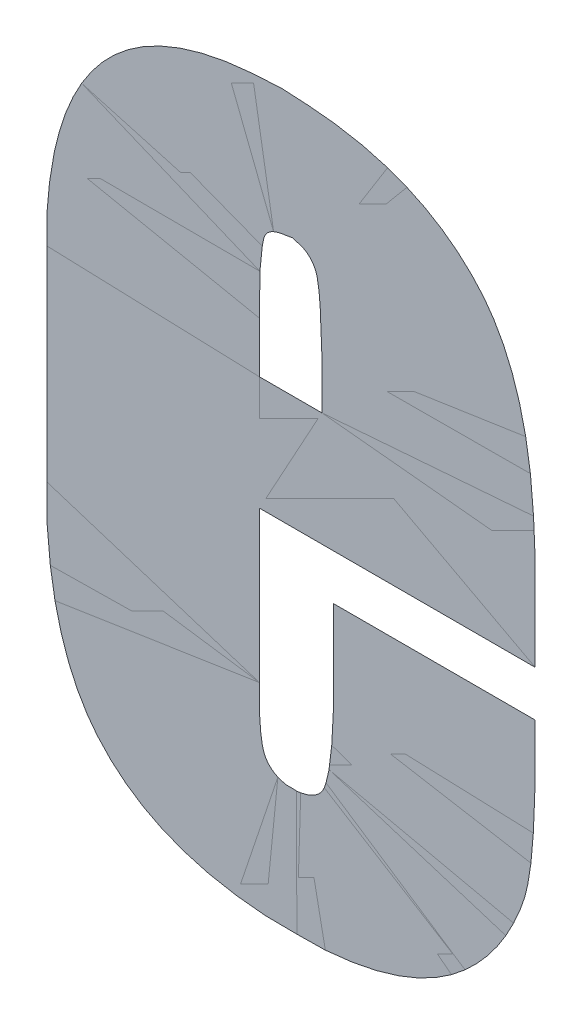
ISO-10303-21;
HEADER;
FILE_DESCRIPTION(('STEP AP214'),'2;1');
FILE_NAME('part.step','',(''),(''),'','','');
FILE_SCHEMA(('AUTOMOTIVE_DESIGN { 1 0 10303 214 1 1 1 1 }'));
ENDSEC;
DATA;
#1=APPLICATION_CONTEXT('core data for automotive mechanical design processes');
#2=APPLICATION_PROTOCOL_DEFINITION('international standard','automotive_design',2000,#1);
#3=PRODUCT_CONTEXT('',#1,'mechanical');
#4=PRODUCT('Part','Part','',(#3));
#5=PRODUCT_RELATED_PRODUCT_CATEGORY('part','',(#4));
#6=PRODUCT_DEFINITION_FORMATION('','',#4);
#7=PRODUCT_DEFINITION_CONTEXT('part definition',#1,'design');
#8=PRODUCT_DEFINITION('design','',#6,#7);
#9=PRODUCT_DEFINITION_SHAPE('','',#8);
#10=(LENGTH_UNIT() NAMED_UNIT(*) SI_UNIT(.MILLI.,.METRE.));
#11=(NAMED_UNIT(*) PLANE_ANGLE_UNIT() SI_UNIT($,.RADIAN.));
#12=(NAMED_UNIT(*) SI_UNIT($,.STERADIAN.) SOLID_ANGLE_UNIT());
#13=UNCERTAINTY_MEASURE_WITH_UNIT(LENGTH_MEASURE(1.E-05),#10,'distance_accuracy_value','');
#14=(GEOMETRIC_REPRESENTATION_CONTEXT(3) GLOBAL_UNCERTAINTY_ASSIGNED_CONTEXT((#13)) GLOBAL_UNIT_ASSIGNED_CONTEXT((#10,
#11,#12)) REPRESENTATION_CONTEXT('',''));
#15=CARTESIAN_POINT('',(0.,0.,0.));
#16=DIRECTION('',(0.,0.,1.));
#17=DIRECTION('',(1.,0.,0.));
#18=AXIS2_PLACEMENT_3D('',#15,#16,#17);
#19=CARTESIAN_POINT('',(6.400952267029,0.774329220897,0.001668));
#20=DIRECTION('',(0.,0.,1.));
#21=DIRECTION('',(1.,0.,0.));
#22=AXIS2_PLACEMENT_3D('',#19,#20,#21);
#23=PLANE('',#22);
#24=CARTESIAN_POINT('',(6.396476040739,0.844309953316,0.001668));
#25=CARTESIAN_POINT('',(6.40095970380509,0.84399688503704,0.001668));
#26=CARTESIAN_POINT('',(6.40272170775,0.840174308944,0.001668));
#27=CARTESIAN_POINT('',(6.40424092405,0.836878448043519,0.001668));
#28=CARTESIAN_POINT('',(6.40424092405,0.821690510628,0.001668));
#29=B_SPLINE_CURVE_WITH_KNOTS('',2,(#24,#25,#26,#27,#28),.UNSPECIFIED.,.F.,.F.,(3,2,3),(0.,0.5,
1.),.UNSPECIFIED.);
#30=CARTESIAN_POINT('',(6.396476040739,0.844309953316,0.0015));
#31=VERTEX_POINT('',#30);
#32=CARTESIAN_POINT('',(6.40424092405,0.821690510628,0.0015));
#33=VERTEX_POINT('',#32);
#34=EDGE_CURVE('E303',#31,#33,#29,.T.);
#35=ORIENTED_EDGE('',*,*,#34,.T.);
#36=CARTESIAN_POINT('',(6.40424092405,0.821690510628,0.001668));
#37=DIRECTION('',(0.,-1.,0.));
#38=VECTOR('',#37,1.);
#39=LINE('',#36,#38);
#40=CARTESIAN_POINT('',(6.40424092405,0.80835516755,0.0015));
#41=VERTEX_POINT('',#40);
#42=EDGE_CURVE('E28',#33,#41,#39,.T.);
#43=ORIENTED_EDGE('',*,*,#42,.T.);
#44=CARTESIAN_POINT('',(6.40424092405,0.80835516755,0.001668));
#45=DIRECTION('',(-1.,0.,0.));
#46=VECTOR('',#45,1.);
#47=LINE('',#44,#46);
#48=CARTESIAN_POINT('',(6.387867148373,0.80835516755,0.0015));
#49=VERTEX_POINT('',#48);
#50=EDGE_CURVE('E11',#41,#49,#47,.T.);
#51=ORIENTED_EDGE('',*,*,#50,.T.);
#52=CARTESIAN_POINT('',(6.387867148373,0.80835516755,0.001668));
#53=DIRECTION('',(0.,1.,0.));
#54=VECTOR('',#53,1.);
#55=LINE('',#52,#54);
#56=CARTESIAN_POINT('',(6.387867148373,0.821690510628,0.0015));
#57=VERTEX_POINT('',#56);
#58=EDGE_CURVE('E101',#49,#57,#55,.T.);
#59=ORIENTED_EDGE('',*,*,#58,.T.);
#60=CARTESIAN_POINT('',(6.387867148373,0.821690510628,0.001668));
#61=CARTESIAN_POINT('',(6.387867148373,0.835948392219936,0.001668));
#62=CARTESIAN_POINT('',(6.3892175628615,0.840765115283,0.001668));
#63=CARTESIAN_POINT('',(6.39012550966034,0.844003623402732,0.001668));
#64=CARTESIAN_POINT('',(6.396476040739,0.844309953316,0.001668));
#65=B_SPLINE_CURVE_WITH_KNOTS('',2,(#60,#61,#62,#63,#64),.UNSPECIFIED.,.F.,.F.,(3,2,3),(0.,0.5,
1.),.UNSPECIFIED.);
#66=EDGE_CURVE('E293',#57,#31,#65,.T.);
#67=ORIENTED_EDGE('',*,*,#66,.T.);
#68=EDGE_LOOP('',(#35,#43,#51,#59,#67));
#69=FACE_BOUND('',#68,.T.);
#70=CARTESIAN_POINT('',(6.39664484255,0.719059009475,0.001668));
#71=CARTESIAN_POINT('',(6.39167394149655,0.719333742862682,0.001668));
#72=CARTESIAN_POINT('',(6.3896395673895,0.722688248414,0.001668));
#73=CARTESIAN_POINT('',(6.387867148373,0.72561081285753,0.001668));
#74=CARTESIAN_POINT('',(6.387867148373,0.738808821375,0.001668));
#75=B_SPLINE_CURVE_WITH_KNOTS('',2,(#70,#71,#72,#73,#74),.UNSPECIFIED.,.F.,.F.,(3,2,3),(0.,0.5,
1.),.UNSPECIFIED.);
#76=CARTESIAN_POINT('',(6.39664484255,0.719059009475,0.0015));
#77=VERTEX_POINT('',#76);
#78=CARTESIAN_POINT('',(6.387867148373,0.738808821375,0.0015));
#79=VERTEX_POINT('',#78);
#80=EDGE_CURVE('E279',#77,#79,#75,.T.);
#81=ORIENTED_EDGE('',*,*,#80,.T.);
#82=CARTESIAN_POINT('',(6.387867148373,0.738808821375,0.001668));
#83=DIRECTION('',(0.,1.,0.));
#84=VECTOR('',#83,1.);
#85=LINE('',#82,#84);
#86=CARTESIAN_POINT('',(6.387867148373,0.778477246985,0.0015));
#87=VERTEX_POINT('',#86);
#88=EDGE_CURVE('E99',#79,#87,#85,.T.);
#89=ORIENTED_EDGE('',*,*,#88,.T.);
#90=CARTESIAN_POINT('',(6.387867148373,0.778477246985,0.001668));
#91=DIRECTION('',(1.,0.,0.));
#92=VECTOR('',#91,1.);
#93=LINE('',#90,#92);
#94=CARTESIAN_POINT('',(6.460283125337,0.778477246985,0.0015));
#95=VERTEX_POINT('',#94);
#96=EDGE_CURVE('E91',#87,#95,#93,.T.);
#97=ORIENTED_EDGE('',*,*,#96,.T.);
#98=CARTESIAN_POINT('',(6.460283125337,0.778477246985,0.001668));
#99=DIRECTION('',(0.,1.,0.));
#100=VECTOR('',#99,1.);
#101=LINE('',#98,#100);
#102=CARTESIAN_POINT('',(6.460283125337,0.802784707784,0.0015));
#103=VERTEX_POINT('',#102);
#104=EDGE_CURVE('E87',#95,#103,#101,.T.);
#105=ORIENTED_EDGE('',*,*,#104,.T.);
#106=CARTESIAN_POINT('',(6.460283125337,0.802784707784,0.001668));
#107=CARTESIAN_POINT('',(6.460283125337,0.841114964543958,0.001668));
#108=CARTESIAN_POINT('',(6.44568176867612,0.857560895487625,0.001668));
#109=CARTESIAN_POINT('',(6.42852176661429,0.876888702859,0.001668));
#110=CARTESIAN_POINT('',(6.393775211761,0.876888702859,0.001668));
#111=B_SPLINE_CURVE_WITH_KNOTS('',2,(#106,#107,#108,#109,#110),.UNSPECIFIED.,.F.,.F.,(3,2,3),
(0.,0.5,1.),.UNSPECIFIED.);
#112=CARTESIAN_POINT('',(6.393775211761,0.876888702859,0.0015));
#113=VERTEX_POINT('',#112);
#114=EDGE_CURVE('E84',#103,#113,#111,.T.);
#115=ORIENTED_EDGE('',*,*,#114,.T.);
#116=CARTESIAN_POINT('',(6.393775211761,0.876888702859,0.001668));
#117=CARTESIAN_POINT('',(6.331993748897,0.876888702859,0.001668));
#118=CARTESIAN_POINT('',(6.331993748897,0.810211987473,0.001668));
#119=B_SPLINE_CURVE_WITH_KNOTS('',2,(#116,#117,#118),.UNSPECIFIED.,.F.,.F.,(3,3),(0.,1.),.UNSPECIFIED.);
#120=CARTESIAN_POINT('',(6.331993748897,0.810211987473,0.0015));
#121=VERTEX_POINT('',#120);
#122=EDGE_CURVE('E228',#113,#121,#119,.T.);
#123=ORIENTED_EDGE('',*,*,#122,.T.);
#124=CARTESIAN_POINT('',(6.331993748897,0.810211987473,0.001668));
#125=DIRECTION('',(0.,-1.,0.));
#126=VECTOR('',#125,1.);
#127=LINE('',#124,#126);
#128=CARTESIAN_POINT('',(6.331993748897,0.756533011541,0.0015));
#129=VERTEX_POINT('',#128);
#130=EDGE_CURVE('E217',#121,#129,#127,.T.);
#131=ORIENTED_EDGE('',*,*,#130,.T.);
#132=CARTESIAN_POINT('',(6.331993748897,0.756533011541,0.001668));
#133=CARTESIAN_POINT('',(6.331993748897,0.721709180952215,0.001668));
#134=CARTESIAN_POINT('',(6.345329091974,0.7057236663975,0.001668));
#135=CARTESIAN_POINT('',(6.36138221471267,0.686480259932,0.001668));
#136=CARTESIAN_POINT('',(6.397657653417,0.686480259932,0.001668));
#137=B_SPLINE_CURVE_WITH_KNOTS('',2,(#132,#133,#134,#135,#136),.UNSPECIFIED.,.F.,.F.,(3,2,3),
(0.,0.5,1.),.UNSPECIFIED.);
#138=CARTESIAN_POINT('',(6.397657653417,0.686480259932,0.0015));
#139=VERTEX_POINT('',#138);
#140=EDGE_CURVE('E226',#129,#139,#137,.T.);
#141=ORIENTED_EDGE('',*,*,#140,.T.);
#142=CARTESIAN_POINT('',(6.397657653417,0.686480259932,0.001668));
#143=CARTESIAN_POINT('',(6.42537103168307,0.686480259932,0.001668));
#144=CARTESIAN_POINT('',(6.4411207437408,0.69984598733484,0.001668));
#145=CARTESIAN_POINT('',(6.45190283933612,0.708996030842314,0.001668));
#146=CARTESIAN_POINT('',(6.45709614714376,0.72312713312268,0.001668));
#147=CARTESIAN_POINT('',(6.460283125337,0.731798969355399,0.001668));
#148=CARTESIAN_POINT('',(6.460283125337,0.752988173508,0.001668));
#149=B_SPLINE_CURVE_WITH_KNOTS('',2,(#142,#143,#144,#145,#146,#147,#148),.UNSPECIFIED.,.F.,.F.,
(3,2,2,3),(0.,0.4,0.7,1.),.UNSPECIFIED.);
#150=CARTESIAN_POINT('',(6.460283125337,0.752988173508,0.0015));
#151=VERTEX_POINT('',#150);
#152=EDGE_CURVE('E230',#139,#151,#149,.T.);
#153=ORIENTED_EDGE('',*,*,#152,.T.);
#154=CARTESIAN_POINT('',(6.460283125337,0.752988173508,0.001668));
#155=DIRECTION('',(0.,1.,0.));
#156=VECTOR('',#155,1.);
#157=LINE('',#154,#156);
#158=CARTESIAN_POINT('',(6.460283125337,0.766492318396,0.0015));
#159=VERTEX_POINT('',#158);
#160=EDGE_CURVE('E359',#151,#159,#157,.T.);
#161=ORIENTED_EDGE('',*,*,#160,.T.);
#162=CARTESIAN_POINT('',(6.460283125337,0.766492318396,0.001668));
#163=DIRECTION('',(-1.,0.,0.));
#164=VECTOR('',#163,1.);
#165=LINE('',#162,#164);
#166=CARTESIAN_POINT('',(6.40727935665,0.766492318396,0.0015));
#167=VERTEX_POINT('',#166);
#168=EDGE_CURVE('E357',#159,#167,#165,.T.);
#169=ORIENTED_EDGE('',*,*,#168,.T.);
#170=CARTESIAN_POINT('',(6.40727935665,0.766492318396,0.001668));
#171=DIRECTION('',(0.,-1.,0.));
#172=VECTOR('',#171,1.);
#173=LINE('',#170,#172);
#174=CARTESIAN_POINT('',(6.40727935665,0.742353659408,0.0015));
#175=VERTEX_POINT('',#174);
#176=EDGE_CURVE('E356',#167,#175,#173,.T.);
#177=ORIENTED_EDGE('',*,*,#176,.T.);
#178=CARTESIAN_POINT('',(6.40727935665,0.742353659408,0.001668));
#179=CARTESIAN_POINT('',(6.40727935665,0.729800524527949,0.001668));
#180=CARTESIAN_POINT('',(6.405169334011,0.7238698610915,0.001668));
#181=CARTESIAN_POINT('',(6.40360585422496,0.71947537155886,0.001668));
#182=CARTESIAN_POINT('',(6.39664484255,0.719059009475,0.001668));
#183=B_SPLINE_CURVE_WITH_KNOTS('',2,(#178,#179,#180,#181,#182),.UNSPECIFIED.,.F.,.F.,(3,2,3),
(0.,0.5,1.),.UNSPECIFIED.);
#184=EDGE_CURVE('E269',#175,#77,#183,.T.);
#185=ORIENTED_EDGE('',*,*,#184,.T.);
#186=EDGE_LOOP('',(#81,#89,#97,#105,#115,#123,#131,#141,#153,#161,#169,#177,#185));
#187=FACE_BOUND('',#186,.T.);
#188=ADVANCED_FACE('F17',(#69,#187),#23,.T.);
#189=CARTESIAN_POINT('',(6.400952267029,0.774329220897,0.001332));
#190=DIRECTION('',(0.,0.,1.));
#191=DIRECTION('',(1.,0.,0.));
#192=AXIS2_PLACEMENT_3D('',#189,#190,#191);
#193=PLANE('',#192);
#194=ORIENTED_EDGE('',*,*,#42,.F.);
#195=ORIENTED_EDGE('',*,*,#34,.F.);
#196=ORIENTED_EDGE('',*,*,#66,.F.);
#197=ORIENTED_EDGE('',*,*,#58,.F.);
#198=ORIENTED_EDGE('',*,*,#50,.F.);
#199=EDGE_LOOP('',(#194,#195,#196,#197,#198));
#200=FACE_BOUND('',#199,.T.);
#201=ORIENTED_EDGE('',*,*,#88,.F.);
#202=ORIENTED_EDGE('',*,*,#80,.F.);
#203=ORIENTED_EDGE('',*,*,#184,.F.);
#204=ORIENTED_EDGE('',*,*,#176,.F.);
#205=ORIENTED_EDGE('',*,*,#168,.F.);
#206=ORIENTED_EDGE('',*,*,#160,.F.);
#207=ORIENTED_EDGE('',*,*,#152,.F.);
#208=ORIENTED_EDGE('',*,*,#140,.F.);
#209=ORIENTED_EDGE('',*,*,#130,.F.);
#210=ORIENTED_EDGE('',*,*,#122,.F.);
#211=ORIENTED_EDGE('',*,*,#114,.F.);
#212=ORIENTED_EDGE('',*,*,#104,.F.);
#213=ORIENTED_EDGE('',*,*,#96,.F.);
#214=EDGE_LOOP('',(#201,#202,#203,#204,#205,#206,#207,#208,#209,#210,#211,#212,#213));
#215=FACE_BOUND('',#214,.T.);
#216=ADVANCED_FACE('F90',(#200,#215),#193,.F.);
#217=CLOSED_SHELL('',(#188,#216));
#218=MANIFOLD_SOLID_BREP('B1',#217);
#219=ADVANCED_BREP_SHAPE_REPRESENTATION('',(#18,#218),#14);
#220=SHAPE_DEFINITION_REPRESENTATION(#9,#219);
ENDSEC;
END-ISO-10303-21;
